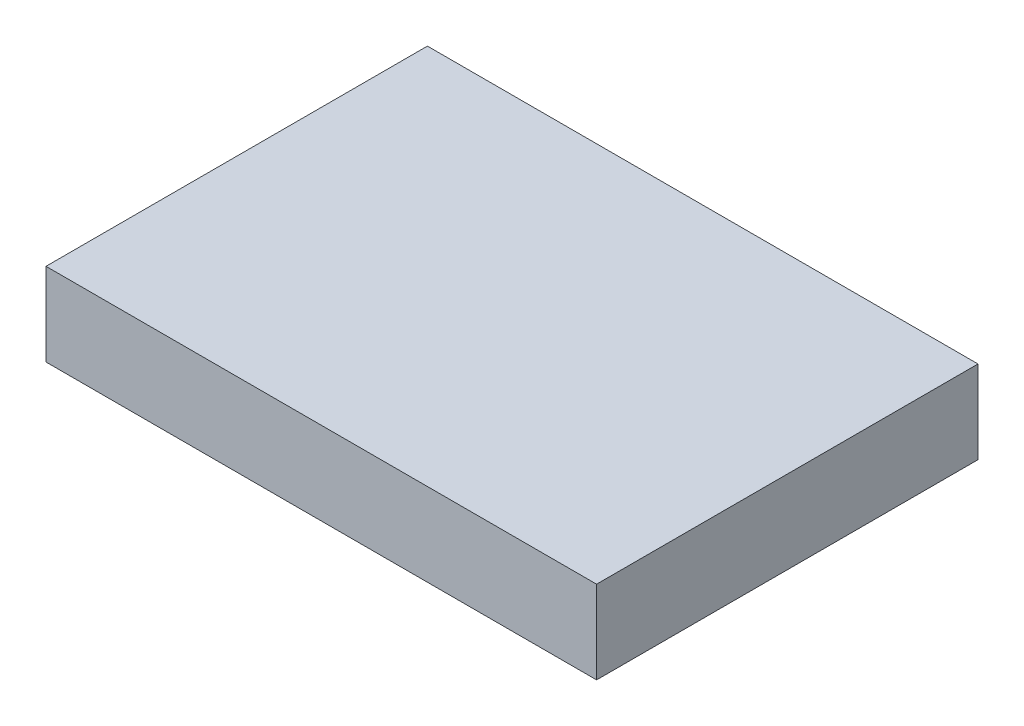
ISO-10303-21;
HEADER;
FILE_DESCRIPTION(('STEP AP214'),'2;1');
FILE_NAME('part.step','',(''),(''),'','','');
FILE_SCHEMA(('AUTOMOTIVE_DESIGN { 1 0 10303 214 1 1 1 1 }'));
ENDSEC;
DATA;
#1=APPLICATION_CONTEXT('core data for automotive mechanical design processes');
#2=APPLICATION_PROTOCOL_DEFINITION('international standard','automotive_design',2000,#1);
#3=PRODUCT_CONTEXT('',#1,'mechanical');
#4=PRODUCT('Part','Part','',(#3));
#5=PRODUCT_RELATED_PRODUCT_CATEGORY('part','',(#4));
#6=PRODUCT_DEFINITION_FORMATION('','',#4);
#7=PRODUCT_DEFINITION_CONTEXT('part definition',#1,'design');
#8=PRODUCT_DEFINITION('design','',#6,#7);
#9=PRODUCT_DEFINITION_SHAPE('','',#8);
#10=(LENGTH_UNIT() NAMED_UNIT(*) SI_UNIT(.MILLI.,.METRE.));
#11=(NAMED_UNIT(*) PLANE_ANGLE_UNIT() SI_UNIT($,.RADIAN.));
#12=(NAMED_UNIT(*) SI_UNIT($,.STERADIAN.) SOLID_ANGLE_UNIT());
#13=UNCERTAINTY_MEASURE_WITH_UNIT(LENGTH_MEASURE(1.E-05),#10,'distance_accuracy_value','');
#14=(GEOMETRIC_REPRESENTATION_CONTEXT(3) GLOBAL_UNCERTAINTY_ASSIGNED_CONTEXT((#13)) GLOBAL_UNIT_ASSIGNED_CONTEXT((#10,
#11,#12)) REPRESENTATION_CONTEXT('',''));
#15=CARTESIAN_POINT('',(0.,0.,0.));
#16=DIRECTION('',(0.,0.,1.));
#17=DIRECTION('',(1.,0.,0.));
#18=AXIS2_PLACEMENT_3D('',#15,#16,#17);
#19=CARTESIAN_POINT('',(0.,0.,0.));
#20=DIRECTION('',(0.,-1.,0.));
#21=DIRECTION('',(0.,0.,-1.));
#22=AXIS2_PLACEMENT_3D('',#19,#20,#21);
#23=PLANE('',#22);
#24=DIRECTION('',(0.,0.,-1.));
#25=VECTOR('',#24,1.);
#26=CARTESIAN_POINT('',(105.41,0.,73.025));
#27=LINE('',#26,#25);
#28=CARTESIAN_POINT('',(105.41,0.,73.025));
#29=VERTEX_POINT('',#28);
#30=CARTESIAN_POINT('',(105.41,0.,-73.025));
#31=VERTEX_POINT('',#30);
#32=EDGE_CURVE('E140',#29,#31,#27,.T.);
#33=ORIENTED_EDGE('',*,*,#32,.F.);
#34=DIRECTION('',(1.,0.,0.));
#35=VECTOR('',#34,1.);
#36=CARTESIAN_POINT('',(-105.41,0.,73.025));
#37=LINE('',#36,#35);
#38=CARTESIAN_POINT('',(-105.41,0.,73.025));
#39=VERTEX_POINT('',#38);
#40=EDGE_CURVE('E85',#39,#29,#37,.T.);
#41=ORIENTED_EDGE('',*,*,#40,.F.);
#42=DIRECTION('',(0.,0.,1.));
#43=VECTOR('',#42,1.);
#44=CARTESIAN_POINT('',(-105.41,0.,73.025));
#45=LINE('',#44,#43);
#46=CARTESIAN_POINT('',(-105.41,0.,-73.025));
#47=VERTEX_POINT('',#46);
#48=EDGE_CURVE('E183',#47,#39,#45,.T.);
#49=ORIENTED_EDGE('',*,*,#48,.F.);
#50=DIRECTION('',(-1.,0.,0.));
#51=VECTOR('',#50,1.);
#52=CARTESIAN_POINT('',(-105.41,0.,-73.025));
#53=LINE('',#52,#51);
#54=EDGE_CURVE('E146',#31,#47,#53,.T.);
#55=ORIENTED_EDGE('',*,*,#54,.F.);
#56=EDGE_LOOP('',(#33,#41,#49,#55));
#57=FACE_BOUND('',#56,.T.);
#58=DIRECTION('',(1.,0.,0.));
#59=VECTOR('',#58,1.);
#60=CARTESIAN_POINT('',(0.,0.,69.977));
#61=LINE('',#60,#59);
#62=CARTESIAN_POINT('',(-102.362,0.,69.977));
#63=VERTEX_POINT('',#62);
#64=CARTESIAN_POINT('',(102.362,0.,69.977));
#65=VERTEX_POINT('',#64);
#66=EDGE_CURVE('E134',#63,#65,#61,.T.);
#67=ORIENTED_EDGE('',*,*,#66,.T.);
#68=DIRECTION('',(0.,0.,-1.));
#69=VECTOR('',#68,1.);
#70=CARTESIAN_POINT('',(102.362,0.,0.));
#71=LINE('',#70,#69);
#72=CARTESIAN_POINT('',(102.362,0.,-69.977));
#73=VERTEX_POINT('',#72);
#74=EDGE_CURVE('E160',#65,#73,#71,.T.);
#75=ORIENTED_EDGE('',*,*,#74,.T.);
#76=DIRECTION('',(-1.,0.,0.));
#77=VECTOR('',#76,1.);
#78=CARTESIAN_POINT('',(0.,0.,-69.977));
#79=LINE('',#78,#77);
#80=CARTESIAN_POINT('',(-102.362,0.,-69.977));
#81=VERTEX_POINT('',#80);
#82=EDGE_CURVE('E138',#73,#81,#79,.T.);
#83=ORIENTED_EDGE('',*,*,#82,.T.);
#84=DIRECTION('',(0.,0.,1.));
#85=VECTOR('',#84,1.);
#86=CARTESIAN_POINT('',(-102.362,0.,0.));
#87=LINE('',#86,#85);
#88=EDGE_CURVE('E55',#81,#63,#87,.T.);
#89=ORIENTED_EDGE('',*,*,#88,.T.);
#90=EDGE_LOOP('',(#67,#75,#83,#89));
#91=FACE_BOUND('',#90,.T.);
#92=ADVANCED_FACE('F39',(#57,#91),#23,.T.);
#93=CARTESIAN_POINT('',(105.41,31.75,73.025));
#94=DIRECTION('',(-1.,0.,0.));
#95=DIRECTION('',(0.,0.,1.));
#96=AXIS2_PLACEMENT_3D('',#93,#94,#95);
#97=PLANE('',#96);
#98=ORIENTED_EDGE('',*,*,#32,.T.);
#99=DIRECTION('',(0.,-1.,0.));
#100=VECTOR('',#99,1.);
#101=CARTESIAN_POINT('',(105.41,31.75,-73.025));
#102=LINE('',#101,#100);
#103=CARTESIAN_POINT('',(105.41,31.75,-73.025));
#104=VERTEX_POINT('',#103);
#105=EDGE_CURVE('E11',#104,#31,#102,.T.);
#106=ORIENTED_EDGE('',*,*,#105,.F.);
#107=DIRECTION('',(0.,0.,-1.));
#108=VECTOR('',#107,1.);
#109=CARTESIAN_POINT('',(105.41,31.75,73.025));
#110=LINE('',#109,#108);
#111=CARTESIAN_POINT('',(105.41,31.75,73.025));
#112=VERTEX_POINT('',#111);
#113=EDGE_CURVE('E170',#112,#104,#110,.T.);
#114=ORIENTED_EDGE('',*,*,#113,.F.);
#115=DIRECTION('',(0.,-1.,0.));
#116=VECTOR('',#115,1.);
#117=CARTESIAN_POINT('',(105.41,31.75,73.025));
#118=LINE('',#117,#116);
#119=EDGE_CURVE('E179',#112,#29,#118,.T.);
#120=ORIENTED_EDGE('',*,*,#119,.T.);
#121=EDGE_LOOP('',(#98,#106,#114,#120));
#122=FACE_BOUND('',#121,.T.);
#123=ADVANCED_FACE('F41',(#122),#97,.F.);
#124=CARTESIAN_POINT('',(-105.41,31.75,-73.025));
#125=DIRECTION('',(0.,0.,1.));
#126=DIRECTION('',(1.,0.,0.));
#127=AXIS2_PLACEMENT_3D('',#124,#125,#126);
#128=PLANE('',#127);
#129=ORIENTED_EDGE('',*,*,#54,.T.);
#130=DIRECTION('',(0.,-1.,0.));
#131=VECTOR('',#130,1.);
#132=CARTESIAN_POINT('',(-105.41,31.75,-73.025));
#133=LINE('',#132,#131);
#134=CARTESIAN_POINT('',(-105.41,31.75,-73.025));
#135=VERTEX_POINT('',#134);
#136=EDGE_CURVE('E48',#135,#47,#133,.T.);
#137=ORIENTED_EDGE('',*,*,#136,.F.);
#138=DIRECTION('',(-1.,0.,0.));
#139=VECTOR('',#138,1.);
#140=CARTESIAN_POINT('',(-105.41,31.75,-73.025));
#141=LINE('',#140,#139);
#142=EDGE_CURVE('E92',#104,#135,#141,.T.);
#143=ORIENTED_EDGE('',*,*,#142,.F.);
#144=ORIENTED_EDGE('',*,*,#105,.T.);
#145=EDGE_LOOP('',(#129,#137,#143,#144));
#146=FACE_BOUND('',#145,.T.);
#147=ADVANCED_FACE('F214',(#146),#128,.F.);
#148=CARTESIAN_POINT('',(-105.41,31.75,73.025));
#149=DIRECTION('',(1.,0.,0.));
#150=DIRECTION('',(0.,0.,-1.));
#151=AXIS2_PLACEMENT_3D('',#148,#149,#150);
#152=PLANE('',#151);
#153=ORIENTED_EDGE('',*,*,#48,.T.);
#154=DIRECTION('',(0.,-1.,0.));
#155=VECTOR('',#154,1.);
#156=CARTESIAN_POINT('',(-105.41,31.75,73.025));
#157=LINE('',#156,#155);
#158=CARTESIAN_POINT('',(-105.41,31.75,73.025));
#159=VERTEX_POINT('',#158);
#160=EDGE_CURVE('E190',#159,#39,#157,.T.);
#161=ORIENTED_EDGE('',*,*,#160,.F.);
#162=DIRECTION('',(0.,0.,1.));
#163=VECTOR('',#162,1.);
#164=CARTESIAN_POINT('',(-105.41,31.75,73.025));
#165=LINE('',#164,#163);
#166=EDGE_CURVE('E175',#135,#159,#165,.T.);
#167=ORIENTED_EDGE('',*,*,#166,.F.);
#168=ORIENTED_EDGE('',*,*,#136,.T.);
#169=EDGE_LOOP('',(#153,#161,#167,#168));
#170=FACE_BOUND('',#169,.T.);
#171=ADVANCED_FACE('F197',(#170),#152,.F.);
#172=CARTESIAN_POINT('',(-105.41,31.75,73.025));
#173=DIRECTION('',(0.,0.,-1.));
#174=DIRECTION('',(-1.,0.,0.));
#175=AXIS2_PLACEMENT_3D('',#172,#173,#174);
#176=PLANE('',#175);
#177=ORIENTED_EDGE('',*,*,#40,.T.);
#178=ORIENTED_EDGE('',*,*,#119,.F.);
#179=DIRECTION('',(1.,0.,0.));
#180=VECTOR('',#179,1.);
#181=CARTESIAN_POINT('',(-105.41,31.75,73.025));
#182=LINE('',#181,#180);
#183=EDGE_CURVE('E64',#159,#112,#182,.T.);
#184=ORIENTED_EDGE('',*,*,#183,.F.);
#185=ORIENTED_EDGE('',*,*,#160,.T.);
#186=EDGE_LOOP('',(#177,#178,#184,#185));
#187=FACE_BOUND('',#186,.T.);
#188=ADVANCED_FACE('F205',(#187),#176,.F.);
#189=CARTESIAN_POINT('',(0.,31.75,0.));
#190=DIRECTION('',(0.,-1.,0.));
#191=DIRECTION('',(0.,0.,-1.));
#192=AXIS2_PLACEMENT_3D('',#189,#190,#191);
#193=PLANE('',#192);
#194=ORIENTED_EDGE('',*,*,#113,.T.);
#195=ORIENTED_EDGE('',*,*,#142,.T.);
#196=ORIENTED_EDGE('',*,*,#166,.T.);
#197=ORIENTED_EDGE('',*,*,#183,.T.);
#198=EDGE_LOOP('',(#194,#195,#196,#197));
#199=FACE_BOUND('',#198,.T.);
#200=ADVANCED_FACE('F207',(#199),#193,.F.);
#201=CARTESIAN_POINT('',(102.362,31.75,73.025));
#202=DIRECTION('',(-1.,0.,0.));
#203=DIRECTION('',(0.,0.,1.));
#204=AXIS2_PLACEMENT_3D('',#201,#202,#203);
#205=PLANE('',#204);
#206=ORIENTED_EDGE('',*,*,#74,.F.);
#207=DIRECTION('',(0.,-1.,0.));
#208=VECTOR('',#207,1.);
#209=CARTESIAN_POINT('',(102.362,31.75,69.977));
#210=LINE('',#209,#208);
#211=CARTESIAN_POINT('',(102.362,28.702,69.977));
#212=VERTEX_POINT('',#211);
#213=EDGE_CURVE('E132',#212,#65,#210,.T.);
#214=ORIENTED_EDGE('',*,*,#213,.F.);
#215=DIRECTION('',(0.,0.,-1.));
#216=VECTOR('',#215,1.);
#217=CARTESIAN_POINT('',(102.362,28.702,0.));
#218=LINE('',#217,#216);
#219=CARTESIAN_POINT('',(102.362,28.702,-69.977));
#220=VERTEX_POINT('',#219);
#221=EDGE_CURVE('E119',#212,#220,#218,.T.);
#222=ORIENTED_EDGE('',*,*,#221,.T.);
#223=DIRECTION('',(0.,-1.,0.));
#224=VECTOR('',#223,1.);
#225=CARTESIAN_POINT('',(102.362,31.75,-69.977));
#226=LINE('',#225,#224);
#227=EDGE_CURVE('E130',#220,#73,#226,.T.);
#228=ORIENTED_EDGE('',*,*,#227,.T.);
#229=EDGE_LOOP('',(#206,#214,#222,#228));
#230=FACE_BOUND('',#229,.T.);
#231=ADVANCED_FACE('F129',(#230),#205,.T.);
#232=CARTESIAN_POINT('',(-105.41,31.75,-69.977));
#233=DIRECTION('',(0.,0.,1.));
#234=DIRECTION('',(1.,0.,0.));
#235=AXIS2_PLACEMENT_3D('',#232,#233,#234);
#236=PLANE('',#235);
#237=ORIENTED_EDGE('',*,*,#82,.F.);
#238=ORIENTED_EDGE('',*,*,#227,.F.);
#239=DIRECTION('',(-1.,0.,0.));
#240=VECTOR('',#239,1.);
#241=CARTESIAN_POINT('',(0.,28.702,-69.977));
#242=LINE('',#241,#240);
#243=CARTESIAN_POINT('',(-102.362,28.702,-69.977));
#244=VERTEX_POINT('',#243);
#245=EDGE_CURVE('E115',#220,#244,#242,.T.);
#246=ORIENTED_EDGE('',*,*,#245,.T.);
#247=DIRECTION('',(0.,-1.,0.));
#248=VECTOR('',#247,1.);
#249=CARTESIAN_POINT('',(-102.362,31.75,-69.977));
#250=LINE('',#249,#248);
#251=EDGE_CURVE('E141',#244,#81,#250,.T.);
#252=ORIENTED_EDGE('',*,*,#251,.T.);
#253=EDGE_LOOP('',(#237,#238,#246,#252));
#254=FACE_BOUND('',#253,.T.);
#255=ADVANCED_FACE('F136',(#254),#236,.T.);
#256=CARTESIAN_POINT('',(-102.362,31.75,73.025));
#257=DIRECTION('',(1.,0.,0.));
#258=DIRECTION('',(0.,0.,-1.));
#259=AXIS2_PLACEMENT_3D('',#256,#257,#258);
#260=PLANE('',#259);
#261=ORIENTED_EDGE('',*,*,#88,.F.);
#262=ORIENTED_EDGE('',*,*,#251,.F.);
#263=DIRECTION('',(0.,0.,1.));
#264=VECTOR('',#263,1.);
#265=CARTESIAN_POINT('',(-102.362,28.702,0.));
#266=LINE('',#265,#264);
#267=CARTESIAN_POINT('',(-102.362,28.702,69.977));
#268=VERTEX_POINT('',#267);
#269=EDGE_CURVE('E120',#244,#268,#266,.T.);
#270=ORIENTED_EDGE('',*,*,#269,.T.);
#271=DIRECTION('',(0.,-1.,0.));
#272=VECTOR('',#271,1.);
#273=CARTESIAN_POINT('',(-102.362,31.75,69.977));
#274=LINE('',#273,#272);
#275=EDGE_CURVE('E148',#268,#63,#274,.T.);
#276=ORIENTED_EDGE('',*,*,#275,.T.);
#277=EDGE_LOOP('',(#261,#262,#270,#276));
#278=FACE_BOUND('',#277,.T.);
#279=ADVANCED_FACE('F227',(#278),#260,.T.);
#280=CARTESIAN_POINT('',(-105.41,31.75,69.977));
#281=DIRECTION('',(0.,0.,-1.));
#282=DIRECTION('',(-1.,0.,0.));
#283=AXIS2_PLACEMENT_3D('',#280,#281,#282);
#284=PLANE('',#283);
#285=ORIENTED_EDGE('',*,*,#66,.F.);
#286=ORIENTED_EDGE('',*,*,#275,.F.);
#287=DIRECTION('',(1.,0.,0.));
#288=VECTOR('',#287,1.);
#289=CARTESIAN_POINT('',(0.,28.702,69.977));
#290=LINE('',#289,#288);
#291=EDGE_CURVE('E152',#268,#212,#290,.T.);
#292=ORIENTED_EDGE('',*,*,#291,.T.);
#293=ORIENTED_EDGE('',*,*,#213,.T.);
#294=EDGE_LOOP('',(#285,#286,#292,#293));
#295=FACE_BOUND('',#294,.T.);
#296=ADVANCED_FACE('F224',(#295),#284,.T.);
#297=CARTESIAN_POINT('',(0.,28.702,0.));
#298=DIRECTION('',(0.,-1.,0.));
#299=DIRECTION('',(0.,0.,-1.));
#300=AXIS2_PLACEMENT_3D('',#297,#298,#299);
#301=PLANE('',#300);
#302=ORIENTED_EDGE('',*,*,#221,.F.);
#303=ORIENTED_EDGE('',*,*,#291,.F.);
#304=ORIENTED_EDGE('',*,*,#269,.F.);
#305=ORIENTED_EDGE('',*,*,#245,.F.);
#306=EDGE_LOOP('',(#302,#303,#304,#305));
#307=FACE_BOUND('',#306,.T.);
#308=ADVANCED_FACE('F117',(#307),#301,.T.);
#309=CLOSED_SHELL('',(#92,#123,#147,#171,#188,#200,#231,#255,#279,#296,#308));
#310=MANIFOLD_SOLID_BREP('B2',#309);
#311=ADVANCED_BREP_SHAPE_REPRESENTATION('',(#18,#310),#14);
#312=SHAPE_DEFINITION_REPRESENTATION(#9,#311);
ENDSEC;
END-ISO-10303-21;
